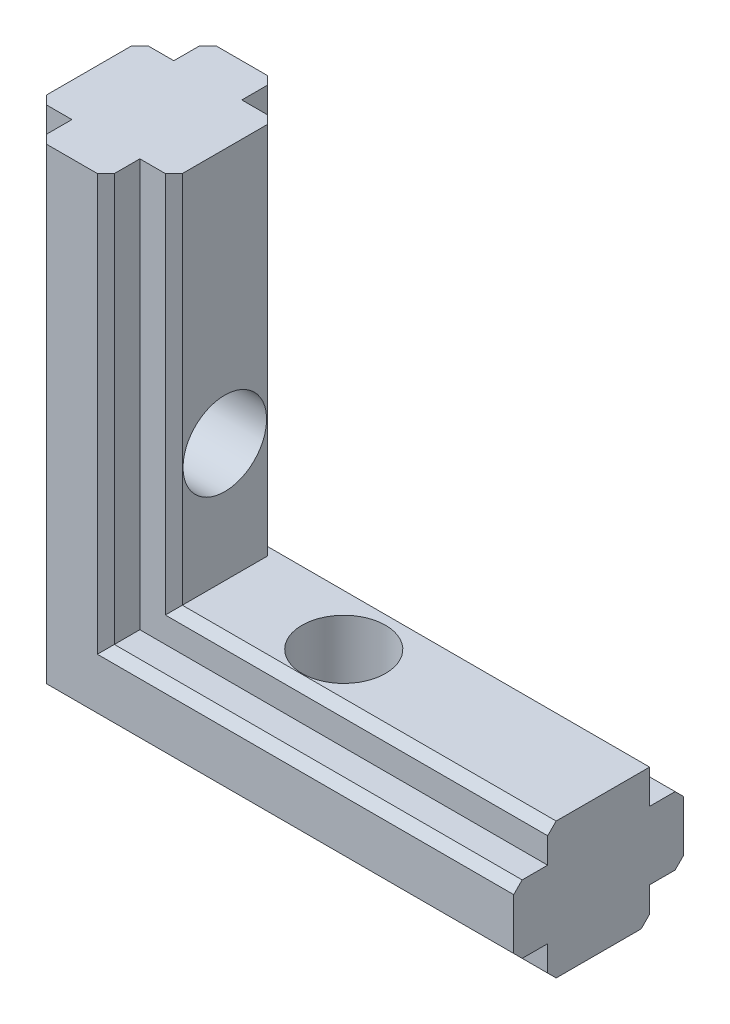
ISO-10303-21;
HEADER;
FILE_DESCRIPTION(('STEP AP214'),'2;1');
FILE_NAME('part.step','',(''),(''),'','','');
FILE_SCHEMA(('AUTOMOTIVE_DESIGN { 1 0 10303 214 1 1 1 1 }'));
ENDSEC;
DATA;
#1=APPLICATION_CONTEXT('core data for automotive mechanical design processes');
#2=APPLICATION_PROTOCOL_DEFINITION('international standard','automotive_design',2000,#1);
#3=PRODUCT_CONTEXT('',#1,'mechanical');
#4=PRODUCT('Part','Part','',(#3));
#5=PRODUCT_RELATED_PRODUCT_CATEGORY('part','',(#4));
#6=PRODUCT_DEFINITION_FORMATION('','',#4);
#7=PRODUCT_DEFINITION_CONTEXT('part definition',#1,'design');
#8=PRODUCT_DEFINITION('design','',#6,#7);
#9=PRODUCT_DEFINITION_SHAPE('','',#8);
#10=(LENGTH_UNIT() NAMED_UNIT(*) SI_UNIT(.MILLI.,.METRE.));
#11=(NAMED_UNIT(*) PLANE_ANGLE_UNIT() SI_UNIT($,.RADIAN.));
#12=(NAMED_UNIT(*) SI_UNIT($,.STERADIAN.) SOLID_ANGLE_UNIT());
#13=UNCERTAINTY_MEASURE_WITH_UNIT(LENGTH_MEASURE(1.E-05),#10,'distance_accuracy_value','');
#14=(GEOMETRIC_REPRESENTATION_CONTEXT(3) GLOBAL_UNCERTAINTY_ASSIGNED_CONTEXT((#13)) GLOBAL_UNIT_ASSIGNED_CONTEXT((#10,
#11,#12)) REPRESENTATION_CONTEXT('',''));
#15=CARTESIAN_POINT('',(0.,0.,0.));
#16=DIRECTION('',(0.,0.,1.));
#17=DIRECTION('',(1.,0.,0.));
#18=AXIS2_PLACEMENT_3D('',#15,#16,#17);
#19=CARTESIAN_POINT('',(30.,2.,0.));
#20=DIRECTION('',(0.,1.,0.));
#21=DIRECTION('',(0.,0.,1.));
#22=AXIS2_PLACEMENT_3D('',#19,#20,#21);
#23=PLANE('',#22);
#24=DIRECTION('',(0.,0.,1.));
#25=VECTOR('',#24,1.);
#26=CARTESIAN_POINT('',(30.,2.,0.));
#27=LINE('',#26,#25);
#28=CARTESIAN_POINT('',(30.,2.,2.));
#29=VERTEX_POINT('',#28);
#30=CARTESIAN_POINT('',(30.,2.,0.5));
#31=VERTEX_POINT('',#30);
#32=EDGE_CURVE('E217',#29,#31,#27,.F.);
#33=ORIENTED_EDGE('',*,*,#32,.F.);
#34=DIRECTION('',(1.,0.,0.));
#35=VECTOR('',#34,1.);
#36=CARTESIAN_POINT('',(1.,2.,2.));
#37=LINE('',#36,#35);
#38=CARTESIAN_POINT('',(2.,2.,2.));
#39=VERTEX_POINT('',#38);
#40=EDGE_CURVE('E211',#29,#39,#37,.F.);
#41=ORIENTED_EDGE('',*,*,#40,.T.);
#42=DIRECTION('',(0.,0.,-1.));
#43=VECTOR('',#42,1.);
#44=CARTESIAN_POINT('',(2.,2.,0.));
#45=LINE('',#44,#43);
#46=CARTESIAN_POINT('',(2.,2.,0.5));
#47=VERTEX_POINT('',#46);
#48=EDGE_CURVE('E224',#39,#47,#45,.T.);
#49=ORIENTED_EDGE('',*,*,#48,.T.);
#50=DIRECTION('',(1.,0.,0.));
#51=VECTOR('',#50,1.);
#52=CARTESIAN_POINT('',(17.,2.,0.5));
#53=LINE('',#52,#51);
#54=EDGE_CURVE('E227',#31,#47,#53,.F.);
#55=ORIENTED_EDGE('',*,*,#54,.F.);
#56=EDGE_LOOP('',(#33,#41,#49,#55));
#57=FACE_BOUND('',#56,.T.);
#58=ADVANCED_FACE('F19',(#57),#23,.F.);
#59=CARTESIAN_POINT('',(2.,2.,0.));
#60=DIRECTION('',(1.,0.,0.));
#61=DIRECTION('',(0.,0.,-1.));
#62=AXIS2_PLACEMENT_3D('',#59,#60,#61);
#63=PLANE('',#62);
#64=ORIENTED_EDGE('',*,*,#48,.F.);
#65=DIRECTION('',(0.,1.,0.));
#66=VECTOR('',#65,1.);
#67=CARTESIAN_POINT('',(2.,16.,2.));
#68=LINE('',#67,#66);
#69=CARTESIAN_POINT('',(2.,30.,2.));
#70=VERTEX_POINT('',#69);
#71=EDGE_CURVE('E236',#39,#70,#68,.T.);
#72=ORIENTED_EDGE('',*,*,#71,.T.);
#73=DIRECTION('',(0.,0.,-1.));
#74=VECTOR('',#73,1.);
#75=CARTESIAN_POINT('',(2.,30.,0.));
#76=LINE('',#75,#74);
#77=CARTESIAN_POINT('',(2.,30.,0.5));
#78=VERTEX_POINT('',#77);
#79=EDGE_CURVE('E230',#78,#70,#76,.F.);
#80=ORIENTED_EDGE('',*,*,#79,.F.);
#81=DIRECTION('',(0.,1.,0.));
#82=VECTOR('',#81,1.);
#83=CARTESIAN_POINT('',(2.,10.5,0.5));
#84=LINE('',#83,#82);
#85=EDGE_CURVE('E454',#47,#78,#84,.T.);
#86=ORIENTED_EDGE('',*,*,#85,.F.);
#87=EDGE_LOOP('',(#64,#72,#80,#86));
#88=FACE_BOUND('',#87,.T.);
#89=ADVANCED_FACE('F721',(#88),#63,.F.);
#90=CARTESIAN_POINT('',(1.,16.,2.));
#91=DIRECTION('',(0.,0.,1.));
#92=DIRECTION('',(1.,0.,0.));
#93=AXIS2_PLACEMENT_3D('',#90,#91,#92);
#94=PLANE('',#93);
#95=DIRECTION('',(1.,0.,0.));
#96=VECTOR('',#95,1.);
#97=CARTESIAN_POINT('',(1.,30.,2.));
#98=LINE('',#97,#96);
#99=CARTESIAN_POINT('',(0.5,30.,2.));
#100=VERTEX_POINT('',#99);
#101=EDGE_CURVE('E241',#70,#100,#98,.F.);
#102=ORIENTED_EDGE('',*,*,#101,.F.);
#103=ORIENTED_EDGE('',*,*,#71,.F.);
#104=ORIENTED_EDGE('',*,*,#40,.F.);
#105=DIRECTION('',(0.,1.,0.));
#106=VECTOR('',#105,1.);
#107=CARTESIAN_POINT('',(30.,16.,2.));
#108=LINE('',#107,#106);
#109=CARTESIAN_POINT('',(30.,0.5,2.));
#110=VERTEX_POINT('',#109);
#111=EDGE_CURVE('E215',#110,#29,#108,.T.);
#112=ORIENTED_EDGE('',*,*,#111,.F.);
#113=DIRECTION('',(1.,0.,0.));
#114=VECTOR('',#113,1.);
#115=CARTESIAN_POINT('',(0.5,0.5,2.));
#116=LINE('',#115,#114);
#117=CARTESIAN_POINT('',(0.5,0.499999999999999,2.));
#118=VERTEX_POINT('',#117);
#119=EDGE_CURVE('E257',#118,#110,#116,.T.);
#120=ORIENTED_EDGE('',*,*,#119,.F.);
#121=DIRECTION('',(0.,1.,0.));
#122=VECTOR('',#121,1.);
#123=CARTESIAN_POINT('',(0.5,23.,2.));
#124=LINE('',#123,#122);
#125=EDGE_CURVE('E390',#100,#118,#124,.F.);
#126=ORIENTED_EDGE('',*,*,#125,.F.);
#127=EDGE_LOOP('',(#102,#103,#104,#112,#120,#126));
#128=FACE_BOUND('',#127,.T.);
#129=ADVANCED_FACE('F234',(#128),#94,.F.);
#130=CARTESIAN_POINT('',(0.25,23.,2.25));
#131=DIRECTION('',(-0.707106781186547,0.,-0.707106781186548));
#132=DIRECTION('',(-0.707106781186548,0.,0.707106781186547));
#133=AXIS2_PLACEMENT_3D('',#130,#131,#132);
#134=PLANE('',#133);
#135=ORIENTED_EDGE('',*,*,#125,.T.);
#136=DIRECTION('',(0.577350269189626,0.577350269189626,-0.577350269189625));
#137=VECTOR('',#136,1.);
#138=CARTESIAN_POINT('',(0.,0.,2.5));
#139=LINE('',#138,#137);
#140=CARTESIAN_POINT('',(0.,0.,2.5));
#141=VERTEX_POINT('',#140);
#142=EDGE_CURVE('E409',#141,#118,#139,.T.);
#143=ORIENTED_EDGE('',*,*,#142,.F.);
#144=DIRECTION('',(0.,1.,0.));
#145=VECTOR('',#144,1.);
#146=CARTESIAN_POINT('',(0.,30.,2.5));
#147=LINE('',#146,#145);
#148=CARTESIAN_POINT('',(0.,30.,2.5));
#149=VERTEX_POINT('',#148);
#150=EDGE_CURVE('E407',#149,#141,#147,.F.);
#151=ORIENTED_EDGE('',*,*,#150,.F.);
#152=DIRECTION('',(-0.707106781186548,0.,0.707106781186547));
#153=VECTOR('',#152,1.);
#154=CARTESIAN_POINT('',(0.25,30.,2.25));
#155=LINE('',#154,#153);
#156=EDGE_CURVE('E394',#149,#100,#155,.F.);
#157=ORIENTED_EDGE('',*,*,#156,.T.);
#158=EDGE_LOOP('',(#135,#143,#151,#157));
#159=FACE_BOUND('',#158,.T.);
#160=ADVANCED_FACE('F405',(#159),#134,.T.);
#161=CARTESIAN_POINT('',(0.25,19.2333333333333,7.75));
#162=DIRECTION('',(-0.707106781186548,0.,0.707106781186548));
#163=DIRECTION('',(0.707106781186548,0.,0.707106781186548));
#164=AXIS2_PLACEMENT_3D('',#161,#162,#163);
#165=PLANE('',#164);
#166=DIRECTION('',(0.,1.,0.));
#167=VECTOR('',#166,1.);
#168=CARTESIAN_POINT('',(0.,30.,7.5));
#169=LINE('',#168,#167);
#170=CARTESIAN_POINT('',(0.,0.,7.5));
#171=VERTEX_POINT('',#170);
#172=CARTESIAN_POINT('',(0.,30.,7.5));
#173=VERTEX_POINT('',#172);
#174=EDGE_CURVE('E415',#171,#173,#169,.T.);
#175=ORIENTED_EDGE('',*,*,#174,.F.);
#176=DIRECTION('',(-0.577350269189625,-0.577350269189626,-0.577350269189626));
#177=VECTOR('',#176,1.);
#178=CARTESIAN_POINT('',(0.499999999999998,0.5,8.));
#179=LINE('',#178,#177);
#180=CARTESIAN_POINT('',(0.499999999999999,0.499999999999997,8.));
#181=VERTEX_POINT('',#180);
#182=EDGE_CURVE('E371',#181,#171,#179,.T.);
#183=ORIENTED_EDGE('',*,*,#182,.F.);
#184=DIRECTION('',(0.,1.,0.));
#185=VECTOR('',#184,1.);
#186=CARTESIAN_POINT('',(0.5,8.46666666666667,8.));
#187=LINE('',#186,#185);
#188=CARTESIAN_POINT('',(0.5,30.,8.));
#189=VERTEX_POINT('',#188);
#190=EDGE_CURVE('E425',#189,#181,#187,.F.);
#191=ORIENTED_EDGE('',*,*,#190,.F.);
#192=DIRECTION('',(0.707106781186548,0.,0.707106781186548));
#193=VECTOR('',#192,1.);
#194=CARTESIAN_POINT('',(0.25,30.,7.75));
#195=LINE('',#194,#193);
#196=EDGE_CURVE('E387',#189,#173,#195,.F.);
#197=ORIENTED_EDGE('',*,*,#196,.T.);
#198=EDGE_LOOP('',(#175,#183,#191,#197));
#199=FACE_BOUND('',#198,.T.);
#200=ADVANCED_FACE('F426',(#199),#165,.T.);
#201=CARTESIAN_POINT('',(7.75,10.4791666666667,7.75));
#202=DIRECTION('',(0.707106781186548,0.,0.707106781186548));
#203=DIRECTION('',(0.707106781186548,0.,-0.707106781186548));
#204=AXIS2_PLACEMENT_3D('',#201,#202,#203);
#205=PLANE('',#204);
#206=DIRECTION('',(0.,1.,0.));
#207=VECTOR('',#206,1.);
#208=CARTESIAN_POINT('',(7.5,12.9583333333333,8.));
#209=LINE('',#208,#207);
#210=CARTESIAN_POINT('',(7.5,7.5,8.));
#211=VERTEX_POINT('',#210);
#212=CARTESIAN_POINT('',(7.5,30.,8.));
#213=VERTEX_POINT('',#212);
#214=EDGE_CURVE('E366',#211,#213,#209,.T.);
#215=ORIENTED_EDGE('',*,*,#214,.F.);
#216=DIRECTION('',(-0.577350269189626,-0.577350269189626,0.577350269189626));
#217=VECTOR('',#216,1.);
#218=CARTESIAN_POINT('',(8.,8.,7.5));
#219=LINE('',#218,#217);
#220=CARTESIAN_POINT('',(8.,8.,7.5));
#221=VERTEX_POINT('',#220);
#222=EDGE_CURVE('E262',#221,#211,#219,.T.);
#223=ORIENTED_EDGE('',*,*,#222,.F.);
#224=DIRECTION('',(0.,1.,0.));
#225=VECTOR('',#224,1.);
#226=CARTESIAN_POINT('',(8.,8.,7.5));
#227=LINE('',#226,#225);
#228=CARTESIAN_POINT('',(8.,30.,7.5));
#229=VERTEX_POINT('',#228);
#230=EDGE_CURVE('E319',#229,#221,#227,.F.);
#231=ORIENTED_EDGE('',*,*,#230,.F.);
#232=DIRECTION('',(0.707106781186548,0.,-0.707106781186548));
#233=VECTOR('',#232,1.);
#234=CARTESIAN_POINT('',(7.75,30.,7.75));
#235=LINE('',#234,#233);
#236=EDGE_CURVE('E383',#229,#213,#235,.F.);
#237=ORIENTED_EDGE('',*,*,#236,.T.);
#238=EDGE_LOOP('',(#215,#223,#231,#237));
#239=FACE_BOUND('',#238,.T.);
#240=ADVANCED_FACE('F675',(#239),#205,.T.);
#241=CARTESIAN_POINT('',(43.5889894354067,15.,5.));
#242=DIRECTION('',(-1.,0.,0.));
#243=DIRECTION('',(0.,0.,1.));
#244=AXIS2_PLACEMENT_3D('',#241,#242,#243);
#245=CYLINDRICAL_SURFACE('',#244,2.4585);
#246=CARTESIAN_POINT('',(0.,15.,5.));
#247=DIRECTION('',(-1.,0.,0.));
#248=DIRECTION('',(0.,0.,1.));
#249=AXIS2_PLACEMENT_3D('',#246,#247,#248);
#250=CIRCLE('',#249,2.4585);
#251=CARTESIAN_POINT('',(0.,15.,7.4585));
#252=VERTEX_POINT('',#251);
#253=EDGE_CURVE('E321',#252,#252,#250,.F.);
#254=ORIENTED_EDGE('',*,*,#253,.F.);
#255=EDGE_LOOP('',(#254));
#256=FACE_BOUND('',#255,.T.);
#257=CARTESIAN_POINT('',(8.,15.,5.));
#258=DIRECTION('',(-1.,0.,0.));
#259=DIRECTION('',(0.,0.,1.));
#260=AXIS2_PLACEMENT_3D('',#257,#258,#259);
#261=CIRCLE('',#260,2.4585);
#262=CARTESIAN_POINT('',(8.,15.,7.4585));
#263=VERTEX_POINT('',#262);
#264=EDGE_CURVE('E313',#263,#263,#261,.T.);
#265=ORIENTED_EDGE('',*,*,#264,.F.);
#266=EDGE_LOOP('',(#265));
#267=FACE_BOUND('',#266,.T.);
#268=ADVANCED_FACE('F731',(#256,#267),#245,.F.);
#269=CARTESIAN_POINT('',(8.46666666666667,8.46666666666667,8.));
#270=DIRECTION('',(0.,0.,1.));
#271=DIRECTION('',(1.,0.,0.));
#272=AXIS2_PLACEMENT_3D('',#269,#270,#271);
#273=PLANE('',#272);
#274=DIRECTION('',(1.,0.,0.));
#275=VECTOR('',#274,1.);
#276=CARTESIAN_POINT('',(8.46666666666667,30.,8.));
#277=LINE('',#276,#275);
#278=CARTESIAN_POINT('',(2.,30.,8.));
#279=VERTEX_POINT('',#278);
#280=EDGE_CURVE('E382',#279,#189,#277,.F.);
#281=ORIENTED_EDGE('',*,*,#280,.T.);
#282=ORIENTED_EDGE('',*,*,#190,.T.);
#283=DIRECTION('',(1.,0.,0.));
#284=VECTOR('',#283,1.);
#285=CARTESIAN_POINT('',(4.23333333333333,0.5,8.));
#286=LINE('',#285,#284);
#287=CARTESIAN_POINT('',(30.,0.5,8.));
#288=VERTEX_POINT('',#287);
#289=EDGE_CURVE('E488',#288,#181,#286,.F.);
#290=ORIENTED_EDGE('',*,*,#289,.F.);
#291=DIRECTION('',(0.,1.,0.));
#292=VECTOR('',#291,1.);
#293=CARTESIAN_POINT('',(30.,8.46666666666667,8.));
#294=LINE('',#293,#292);
#295=CARTESIAN_POINT('',(30.,2.,8.));
#296=VERTEX_POINT('',#295);
#297=EDGE_CURVE('E376',#288,#296,#294,.T.);
#298=ORIENTED_EDGE('',*,*,#297,.T.);
#299=DIRECTION('',(1.,0.,0.));
#300=VECTOR('',#299,1.);
#301=CARTESIAN_POINT('',(2.,2.,8.));
#302=LINE('',#301,#300);
#303=CARTESIAN_POINT('',(2.,2.,8.));
#304=VERTEX_POINT('',#303);
#305=EDGE_CURVE('E511',#296,#304,#302,.F.);
#306=ORIENTED_EDGE('',*,*,#305,.T.);
#307=DIRECTION('',(0.,1.,0.));
#308=VECTOR('',#307,1.);
#309=CARTESIAN_POINT('',(2.,30.,8.));
#310=LINE('',#309,#308);
#311=EDGE_CURVE('E318',#304,#279,#310,.T.);
#312=ORIENTED_EDGE('',*,*,#311,.T.);
#313=EDGE_LOOP('',(#281,#282,#290,#298,#306,#312));
#314=FACE_BOUND('',#313,.T.);
#315=ADVANCED_FACE('F433',(#314),#273,.T.);
#316=CARTESIAN_POINT('',(17.,2.25,0.25));
#317=DIRECTION('',(0.,-0.707106781186548,-0.707106781186547));
#318=DIRECTION('',(0.,0.707106781186547,-0.707106781186548));
#319=AXIS2_PLACEMENT_3D('',#316,#317,#318);
#320=PLANE('',#319);
#321=ORIENTED_EDGE('',*,*,#54,.T.);
#322=DIRECTION('',(-0.577350269189625,-0.577350269189626,0.577350269189626));
#323=VECTOR('',#322,1.);
#324=CARTESIAN_POINT('',(2.5,2.5,0.));
#325=LINE('',#324,#323);
#326=CARTESIAN_POINT('',(2.5,2.5,0.));
#327=VERTEX_POINT('',#326);
#328=EDGE_CURVE('E461',#327,#47,#325,.T.);
#329=ORIENTED_EDGE('',*,*,#328,.F.);
#330=DIRECTION('',(1.,0.,0.));
#331=VECTOR('',#330,1.);
#332=CARTESIAN_POINT('',(4.,2.5,0.));
#333=LINE('',#332,#331);
#334=CARTESIAN_POINT('',(30.,2.5,0.));
#335=VERTEX_POINT('',#334);
#336=EDGE_CURVE('E517',#327,#335,#333,.T.);
#337=ORIENTED_EDGE('',*,*,#336,.T.);
#338=DIRECTION('',(0.,0.707106781186547,-0.707106781186548));
#339=VECTOR('',#338,1.);
#340=CARTESIAN_POINT('',(30.,2.25,0.25));
#341=LINE('',#340,#339);
#342=EDGE_CURVE('E432',#335,#31,#341,.F.);
#343=ORIENTED_EDGE('',*,*,#342,.T.);
#344=EDGE_LOOP('',(#321,#329,#337,#343));
#345=FACE_BOUND('',#344,.T.);
#346=ADVANCED_FACE('F723',(#345),#320,.T.);
#347=CARTESIAN_POINT('',(6.,5.75,0.25));
#348=DIRECTION('',(0.,0.707106781186547,-0.707106781186548));
#349=DIRECTION('',(0.,0.707106781186548,0.707106781186547));
#350=AXIS2_PLACEMENT_3D('',#347,#348,#349);
#351=PLANE('',#350);
#352=DIRECTION('',(1.,0.,0.));
#353=VECTOR('',#352,1.);
#354=CARTESIAN_POINT('',(4.,5.5,0.));
#355=LINE('',#354,#353);
#356=CARTESIAN_POINT('',(30.,5.5,0.));
#357=VERTEX_POINT('',#356);
#358=CARTESIAN_POINT('',(5.5,5.5,0.));
#359=VERTEX_POINT('',#358);
#360=EDGE_CURVE('E520',#357,#359,#355,.F.);
#361=ORIENTED_EDGE('',*,*,#360,.T.);
#362=DIRECTION('',(-0.577350269189626,-0.577350269189626,-0.577350269189625));
#363=VECTOR('',#362,1.);
#364=CARTESIAN_POINT('',(6.,6.,0.5));
#365=LINE('',#364,#363);
#366=CARTESIAN_POINT('',(6.,5.99999999999999,0.499999999999999));
#367=VERTEX_POINT('',#366);
#368=EDGE_CURVE('E450',#367,#359,#365,.T.);
#369=ORIENTED_EDGE('',*,*,#368,.F.);
#370=DIRECTION('',(1.,0.,0.));
#371=VECTOR('',#370,1.);
#372=CARTESIAN_POINT('',(8.,6.,0.5));
#373=LINE('',#372,#371);
#374=CARTESIAN_POINT('',(30.,6.,0.5));
#375=VERTEX_POINT('',#374);
#376=EDGE_CURVE('E479',#367,#375,#373,.T.);
#377=ORIENTED_EDGE('',*,*,#376,.T.);
#378=DIRECTION('',(0.,0.707106781186548,0.707106781186547));
#379=VECTOR('',#378,1.);
#380=CARTESIAN_POINT('',(30.,5.75,0.25));
#381=LINE('',#380,#379);
#382=EDGE_CURVE('E443',#375,#357,#381,.F.);
#383=ORIENTED_EDGE('',*,*,#382,.T.);
#384=EDGE_LOOP('',(#361,#369,#377,#383));
#385=FACE_BOUND('',#384,.T.);
#386=ADVANCED_FACE('F706',(#385),#351,.T.);
#387=CARTESIAN_POINT('',(5.75,24.5,0.25));
#388=DIRECTION('',(0.707106781186547,0.,-0.707106781186548));
#389=DIRECTION('',(-0.707106781186548,0.,-0.707106781186547));
#390=AXIS2_PLACEMENT_3D('',#387,#388,#389);
#391=PLANE('',#390);
#392=DIRECTION('',(0.,1.,0.));
#393=VECTOR('',#392,1.);
#394=CARTESIAN_POINT('',(6.,30.,0.5));
#395=LINE('',#394,#393);
#396=CARTESIAN_POINT('',(6.,30.,0.5));
#397=VERTEX_POINT('',#396);
#398=EDGE_CURVE('E468',#397,#367,#395,.F.);
#399=ORIENTED_EDGE('',*,*,#398,.T.);
#400=ORIENTED_EDGE('',*,*,#368,.T.);
#401=DIRECTION('',(0.,1.,0.));
#402=VECTOR('',#401,1.);
#403=CARTESIAN_POINT('',(5.5,19.,0.));
#404=LINE('',#403,#402);
#405=CARTESIAN_POINT('',(5.5,30.,0.));
#406=VERTEX_POINT('',#405);
#407=EDGE_CURVE('E523',#359,#406,#404,.T.);
#408=ORIENTED_EDGE('',*,*,#407,.T.);
#409=DIRECTION('',(-0.707106781186548,0.,-0.707106781186547));
#410=VECTOR('',#409,1.);
#411=CARTESIAN_POINT('',(5.75,30.,0.25));
#412=LINE('',#411,#410);
#413=EDGE_CURVE('E446',#406,#397,#412,.F.);
#414=ORIENTED_EDGE('',*,*,#413,.T.);
#415=EDGE_LOOP('',(#399,#400,#408,#414));
#416=FACE_BOUND('',#415,.T.);
#417=ADVANCED_FACE('F710',(#416),#391,.T.);
#418=CARTESIAN_POINT('',(2.25,10.5,0.25));
#419=DIRECTION('',(-0.707106781186548,0.,-0.707106781186547));
#420=DIRECTION('',(-0.707106781186547,0.,0.707106781186548));
#421=AXIS2_PLACEMENT_3D('',#418,#419,#420);
#422=PLANE('',#421);
#423=DIRECTION('',(0.,1.,0.));
#424=VECTOR('',#423,1.);
#425=CARTESIAN_POINT('',(2.5,19.,0.));
#426=LINE('',#425,#424);
#427=CARTESIAN_POINT('',(2.5,30.,0.));
#428=VERTEX_POINT('',#427);
#429=EDGE_CURVE('E527',#428,#327,#426,.F.);
#430=ORIENTED_EDGE('',*,*,#429,.T.);
#431=ORIENTED_EDGE('',*,*,#328,.T.);
#432=ORIENTED_EDGE('',*,*,#85,.T.);
#433=DIRECTION('',(-0.707106781186547,0.,0.707106781186548));
#434=VECTOR('',#433,1.);
#435=CARTESIAN_POINT('',(2.25,30.,0.25));
#436=LINE('',#435,#434);
#437=EDGE_CURVE('E458',#78,#428,#436,.F.);
#438=ORIENTED_EDGE('',*,*,#437,.T.);
#439=EDGE_LOOP('',(#430,#431,#432,#438));
#440=FACE_BOUND('',#439,.T.);
#441=ADVANCED_FACE('F718',(#440),#422,.T.);
#442=CARTESIAN_POINT('',(6.,30.,0.));
#443=DIRECTION('',(-1.,0.,0.));
#444=DIRECTION('',(0.,0.,1.));
#445=AXIS2_PLACEMENT_3D('',#442,#443,#444);
#446=PLANE('',#445);
#447=DIRECTION('',(0.,0.,1.));
#448=VECTOR('',#447,1.);
#449=CARTESIAN_POINT('',(6.,30.,0.));
#450=LINE('',#449,#448);
#451=CARTESIAN_POINT('',(6.,30.,2.));
#452=VERTEX_POINT('',#451);
#453=EDGE_CURVE('E465',#452,#397,#450,.F.);
#454=ORIENTED_EDGE('',*,*,#453,.F.);
#455=DIRECTION('',(0.,1.,0.));
#456=VECTOR('',#455,1.);
#457=CARTESIAN_POINT('',(6.,7.,2.));
#458=LINE('',#457,#456);
#459=CARTESIAN_POINT('',(6.,6.,2.));
#460=VERTEX_POINT('',#459);
#461=EDGE_CURVE('E531',#452,#460,#458,.F.);
#462=ORIENTED_EDGE('',*,*,#461,.T.);
#463=DIRECTION('',(0.,0.,-1.));
#464=VECTOR('',#463,1.);
#465=CARTESIAN_POINT('',(6.,6.,0.));
#466=LINE('',#465,#464);
#467=EDGE_CURVE('E475',#460,#367,#466,.T.);
#468=ORIENTED_EDGE('',*,*,#467,.T.);
#469=ORIENTED_EDGE('',*,*,#398,.F.);
#470=EDGE_LOOP('',(#454,#462,#468,#469));
#471=FACE_BOUND('',#470,.T.);
#472=ADVANCED_FACE('F699',(#471),#446,.F.);
#473=CARTESIAN_POINT('',(8.,6.,0.));
#474=DIRECTION('',(0.,-1.,0.));
#475=DIRECTION('',(0.,0.,-1.));
#476=AXIS2_PLACEMENT_3D('',#473,#474,#475);
#477=PLANE('',#476);
#478=ORIENTED_EDGE('',*,*,#467,.F.);
#479=DIRECTION('',(1.,0.,0.));
#480=VECTOR('',#479,1.);
#481=CARTESIAN_POINT('',(19.,6.,2.));
#482=LINE('',#481,#480);
#483=CARTESIAN_POINT('',(30.,6.,2.));
#484=VERTEX_POINT('',#483);
#485=EDGE_CURVE('E298',#460,#484,#482,.T.);
#486=ORIENTED_EDGE('',*,*,#485,.T.);
#487=DIRECTION('',(0.,0.,-1.));
#488=VECTOR('',#487,1.);
#489=CARTESIAN_POINT('',(30.,6.,0.));
#490=LINE('',#489,#488);
#491=EDGE_CURVE('E472',#375,#484,#490,.F.);
#492=ORIENTED_EDGE('',*,*,#491,.F.);
#493=ORIENTED_EDGE('',*,*,#376,.F.);
#494=EDGE_LOOP('',(#478,#486,#492,#493));
#495=FACE_BOUND('',#494,.T.);
#496=ADVANCED_FACE('F703',(#495),#477,.F.);
#497=CARTESIAN_POINT('',(7.75,7.5,2.25));
#498=DIRECTION('',(0.707106781186547,0.,-0.707106781186548));
#499=DIRECTION('',(-0.707106781186548,0.,-0.707106781186547));
#500=AXIS2_PLACEMENT_3D('',#497,#498,#499);
#501=PLANE('',#500);
#502=DIRECTION('',(-0.707106781186548,0.,-0.707106781186547));
#503=VECTOR('',#502,1.);
#504=CARTESIAN_POINT('',(7.75,8.,2.25));
#505=LINE('',#504,#503);
#506=CARTESIAN_POINT('',(8.,8.,2.5));
#507=VERTEX_POINT('',#506);
#508=CARTESIAN_POINT('',(7.5,8.,2.));
#509=VERTEX_POINT('',#508);
#510=EDGE_CURVE('E270',#507,#509,#505,.T.);
#511=ORIENTED_EDGE('',*,*,#510,.T.);
#512=DIRECTION('',(0.,1.,0.));
#513=VECTOR('',#512,1.);
#514=CARTESIAN_POINT('',(7.5,7.,2.));
#515=LINE('',#514,#513);
#516=CARTESIAN_POINT('',(7.5,30.,2.));
#517=VERTEX_POINT('',#516);
#518=EDGE_CURVE('E292',#509,#517,#515,.T.);
#519=ORIENTED_EDGE('',*,*,#518,.T.);
#520=DIRECTION('',(-0.707106781186548,0.,-0.707106781186547));
#521=VECTOR('',#520,1.);
#522=CARTESIAN_POINT('',(7.75,30.,2.25));
#523=LINE('',#522,#521);
#524=CARTESIAN_POINT('',(8.,30.,2.5));
#525=VERTEX_POINT('',#524);
#526=EDGE_CURVE('E274',#517,#525,#523,.F.);
#527=ORIENTED_EDGE('',*,*,#526,.T.);
#528=DIRECTION('',(0.,1.,0.));
#529=VECTOR('',#528,1.);
#530=CARTESIAN_POINT('',(8.,8.,2.5));
#531=LINE('',#530,#529);
#532=EDGE_CURVE('E501',#507,#525,#531,.T.);
#533=ORIENTED_EDGE('',*,*,#532,.F.);
#534=EDGE_LOOP('',(#511,#519,#527,#533));
#535=FACE_BOUND('',#534,.T.);
#536=ADVANCED_FACE('F690',(#535),#501,.T.);
#537=CARTESIAN_POINT('',(21.4791666666667,7.75,7.75));
#538=DIRECTION('',(0.,0.707106781186548,0.707106781186547));
#539=DIRECTION('',(0.,-0.707106781186547,0.707106781186548));
#540=AXIS2_PLACEMENT_3D('',#537,#538,#539);
#541=PLANE('',#540);
#542=DIRECTION('',(1.,0.,0.));
#543=VECTOR('',#542,1.);
#544=CARTESIAN_POINT('',(30.,8.,7.5));
#545=LINE('',#544,#543);
#546=CARTESIAN_POINT('',(30.,8.,7.5));
#547=VERTEX_POINT('',#546);
#548=EDGE_CURVE('E285',#221,#547,#545,.T.);
#549=ORIENTED_EDGE('',*,*,#548,.F.);
#550=ORIENTED_EDGE('',*,*,#222,.T.);
#551=DIRECTION('',(1.,0.,0.));
#552=VECTOR('',#551,1.);
#553=CARTESIAN_POINT('',(12.9583333333333,7.5,8.));
#554=LINE('',#553,#552);
#555=CARTESIAN_POINT('',(30.,7.5,8.));
#556=VERTEX_POINT('',#555);
#557=EDGE_CURVE('E360',#556,#211,#554,.F.);
#558=ORIENTED_EDGE('',*,*,#557,.F.);
#559=DIRECTION('',(0.,-0.707106781186547,0.707106781186548));
#560=VECTOR('',#559,1.);
#561=CARTESIAN_POINT('',(30.,7.75,7.75));
#562=LINE('',#561,#560);
#563=EDGE_CURVE('E267',#556,#547,#562,.F.);
#564=ORIENTED_EDGE('',*,*,#563,.T.);
#565=EDGE_LOOP('',(#549,#550,#558,#564));
#566=FACE_BOUND('',#565,.T.);
#567=ADVANCED_FACE('F679',(#566),#541,.T.);
#568=CARTESIAN_POINT('',(0.5,0.25,2.25));
#569=DIRECTION('',(0.,-0.707106781186547,-0.707106781186548));
#570=DIRECTION('',(0.,0.707106781186548,-0.707106781186547));
#571=AXIS2_PLACEMENT_3D('',#568,#569,#570);
#572=PLANE('',#571);
#573=DIRECTION('',(1.,0.,0.));
#574=VECTOR('',#573,1.);
#575=CARTESIAN_POINT('',(0.,0.,2.5));
#576=LINE('',#575,#574);
#577=CARTESIAN_POINT('',(30.,0.,2.5));
#578=VERTEX_POINT('',#577);
#579=EDGE_CURVE('E543',#141,#578,#576,.T.);
#580=ORIENTED_EDGE('',*,*,#579,.F.);
#581=ORIENTED_EDGE('',*,*,#142,.T.);
#582=ORIENTED_EDGE('',*,*,#119,.T.);
#583=DIRECTION('',(0.,0.707106781186548,-0.707106781186547));
#584=VECTOR('',#583,1.);
#585=CARTESIAN_POINT('',(30.,0.25,2.25));
#586=LINE('',#585,#584);
#587=EDGE_CURVE('E220',#110,#578,#586,.F.);
#588=ORIENTED_EDGE('',*,*,#587,.T.);
#589=EDGE_LOOP('',(#580,#581,#582,#588));
#590=FACE_BOUND('',#589,.T.);
#591=ADVANCED_FACE('F783',(#590),#572,.T.);
#592=CARTESIAN_POINT('',(4.23333333333333,0.25,7.75));
#593=DIRECTION('',(0.,-0.707106781186548,0.707106781186548));
#594=DIRECTION('',(0.,-0.707106781186548,-0.707106781186548));
#595=AXIS2_PLACEMENT_3D('',#592,#593,#594);
#596=PLANE('',#595);
#597=ORIENTED_EDGE('',*,*,#289,.T.);
#598=ORIENTED_EDGE('',*,*,#182,.T.);
#599=DIRECTION('',(1.,0.,0.));
#600=VECTOR('',#599,1.);
#601=CARTESIAN_POINT('',(0.,0.,7.5));
#602=LINE('',#601,#600);
#603=CARTESIAN_POINT('',(30.,0.,7.5));
#604=VERTEX_POINT('',#603);
#605=EDGE_CURVE('E546',#604,#171,#602,.F.);
#606=ORIENTED_EDGE('',*,*,#605,.F.);
#607=DIRECTION('',(0.,-0.707106781186548,-0.707106781186548));
#608=VECTOR('',#607,1.);
#609=CARTESIAN_POINT('',(30.,0.25,7.75));
#610=LINE('',#609,#608);
#611=EDGE_CURVE('E485',#604,#288,#610,.F.);
#612=ORIENTED_EDGE('',*,*,#611,.T.);
#613=EDGE_LOOP('',(#597,#598,#606,#612));
#614=FACE_BOUND('',#613,.T.);
#615=ADVANCED_FACE('F779',(#614),#596,.T.);
#616=CARTESIAN_POINT('',(15.,43.5889894354067,5.));
#617=DIRECTION('',(0.,-1.,0.));
#618=DIRECTION('',(0.,0.,-1.));
#619=AXIS2_PLACEMENT_3D('',#616,#617,#618);
#620=CYLINDRICAL_SURFACE('',#619,2.4585);
#621=CARTESIAN_POINT('',(15.,0.,5.));
#622=DIRECTION('',(0.,-1.,0.));
#623=DIRECTION('',(0.,0.,-1.));
#624=AXIS2_PLACEMENT_3D('',#621,#622,#623);
#625=CIRCLE('',#624,2.4585);
#626=CARTESIAN_POINT('',(15.,0.,2.5415));
#627=VERTEX_POINT('',#626);
#628=EDGE_CURVE('E552',#627,#627,#625,.F.);
#629=ORIENTED_EDGE('',*,*,#628,.F.);
#630=EDGE_LOOP('',(#629));
#631=FACE_BOUND('',#630,.T.);
#632=CARTESIAN_POINT('',(15.,8.,5.));
#633=DIRECTION('',(0.,-1.,0.));
#634=DIRECTION('',(0.,0.,-1.));
#635=AXIS2_PLACEMENT_3D('',#632,#633,#634);
#636=CIRCLE('',#635,2.4585);
#637=CARTESIAN_POINT('',(15.,8.,2.5415));
#638=VERTEX_POINT('',#637);
#639=EDGE_CURVE('E311',#638,#638,#636,.T.);
#640=ORIENTED_EDGE('',*,*,#639,.F.);
#641=EDGE_LOOP('',(#640));
#642=FACE_BOUND('',#641,.T.);
#643=ADVANCED_FACE('F776',(#631,#642),#620,.F.);
#644=CARTESIAN_POINT('',(12.9583333333333,12.9583333333333,8.));
#645=DIRECTION('',(0.,0.,1.));
#646=DIRECTION('',(1.,0.,0.));
#647=AXIS2_PLACEMENT_3D('',#644,#645,#646);
#648=PLANE('',#647);
#649=DIRECTION('',(0.,1.,0.));
#650=VECTOR('',#649,1.);
#651=CARTESIAN_POINT('',(30.,12.9583333333333,8.));
#652=LINE('',#651,#650);
#653=CARTESIAN_POINT('',(30.,6.,8.));
#654=VERTEX_POINT('',#653);
#655=EDGE_CURVE('E354',#654,#556,#652,.T.);
#656=ORIENTED_EDGE('',*,*,#655,.T.);
#657=ORIENTED_EDGE('',*,*,#557,.T.);
#658=ORIENTED_EDGE('',*,*,#214,.T.);
#659=DIRECTION('',(1.,0.,0.));
#660=VECTOR('',#659,1.);
#661=CARTESIAN_POINT('',(12.9583333333333,30.,8.));
#662=LINE('',#661,#660);
#663=CARTESIAN_POINT('',(6.,30.,8.));
#664=VERTEX_POINT('',#663);
#665=EDGE_CURVE('E361',#213,#664,#662,.F.);
#666=ORIENTED_EDGE('',*,*,#665,.T.);
#667=DIRECTION('',(0.,1.,0.));
#668=VECTOR('',#667,1.);
#669=CARTESIAN_POINT('',(6.,6.,8.));
#670=LINE('',#669,#668);
#671=CARTESIAN_POINT('',(6.,6.,8.));
#672=VERTEX_POINT('',#671);
#673=EDGE_CURVE('E416',#664,#672,#670,.F.);
#674=ORIENTED_EDGE('',*,*,#673,.T.);
#675=DIRECTION('',(1.,0.,0.));
#676=VECTOR('',#675,1.);
#677=CARTESIAN_POINT('',(30.,6.,8.));
#678=LINE('',#677,#676);
#679=EDGE_CURVE('E346',#672,#654,#678,.T.);
#680=ORIENTED_EDGE('',*,*,#679,.T.);
#681=EDGE_LOOP('',(#656,#657,#658,#666,#674,#680));
#682=FACE_BOUND('',#681,.T.);
#683=ADVANCED_FACE('F672',(#682),#648,.T.);
#684=CARTESIAN_POINT('',(6.,6.,10.));
#685=DIRECTION('',(-1.,0.,0.));
#686=DIRECTION('',(0.,0.,1.));
#687=AXIS2_PLACEMENT_3D('',#684,#685,#686);
#688=PLANE('',#687);
#689=DIRECTION('',(0.,0.,-1.));
#690=VECTOR('',#689,1.);
#691=CARTESIAN_POINT('',(6.,6.,10.));
#692=LINE('',#691,#690);
#693=CARTESIAN_POINT('',(6.,6.,9.5));
#694=VERTEX_POINT('',#693);
#695=EDGE_CURVE('E350',#694,#672,#692,.T.);
#696=ORIENTED_EDGE('',*,*,#695,.T.);
#697=ORIENTED_EDGE('',*,*,#673,.F.);
#698=DIRECTION('',(0.,0.,1.));
#699=VECTOR('',#698,1.);
#700=CARTESIAN_POINT('',(6.,30.,10.));
#701=LINE('',#700,#699);
#702=CARTESIAN_POINT('',(6.,30.,9.5));
#703=VERTEX_POINT('',#702);
#704=EDGE_CURVE('E494',#703,#664,#701,.F.);
#705=ORIENTED_EDGE('',*,*,#704,.F.);
#706=DIRECTION('',(0.,1.,0.));
#707=VECTOR('',#706,1.);
#708=CARTESIAN_POINT('',(6.,12.5,9.5));
#709=LINE('',#708,#707);
#710=EDGE_CURVE('E342',#694,#703,#709,.T.);
#711=ORIENTED_EDGE('',*,*,#710,.F.);
#712=EDGE_LOOP('',(#696,#697,#705,#711));
#713=FACE_BOUND('',#712,.T.);
#714=ADVANCED_FACE('F669',(#713),#688,.F.);
#715=CARTESIAN_POINT('',(0.,30.,0.));
#716=DIRECTION('',(-1.,0.,0.));
#717=DIRECTION('',(0.,0.,1.));
#718=AXIS2_PLACEMENT_3D('',#715,#716,#717);
#719=PLANE('',#718);
#720=ORIENTED_EDGE('',*,*,#253,.T.);
#721=EDGE_LOOP('',(#720));
#722=FACE_BOUND('',#721,.T.);
#723=ORIENTED_EDGE('',*,*,#174,.T.);
#724=DIRECTION('',(0.,0.,1.));
#725=VECTOR('',#724,1.);
#726=CARTESIAN_POINT('',(0.,30.,0.));
#727=LINE('',#726,#725);
#728=EDGE_CURVE('E337',#149,#173,#727,.T.);
#729=ORIENTED_EDGE('',*,*,#728,.F.);
#730=ORIENTED_EDGE('',*,*,#150,.T.);
#731=DIRECTION('',(0.,0.,-1.));
#732=VECTOR('',#731,1.);
#733=CARTESIAN_POINT('',(0.,0.,0.));
#734=LINE('',#733,#732);
#735=EDGE_CURVE('E549',#171,#141,#734,.T.);
#736=ORIENTED_EDGE('',*,*,#735,.F.);
#737=EDGE_LOOP('',(#723,#729,#730,#736));
#738=FACE_BOUND('',#737,.T.);
#739=ADVANCED_FACE('F419',(#722,#738),#719,.T.);
#740=CARTESIAN_POINT('',(8.,8.,0.));
#741=DIRECTION('',(1.,0.,0.));
#742=DIRECTION('',(0.,0.,-1.));
#743=AXIS2_PLACEMENT_3D('',#740,#741,#742);
#744=PLANE('',#743);
#745=ORIENTED_EDGE('',*,*,#264,.T.);
#746=EDGE_LOOP('',(#745));
#747=FACE_BOUND('',#746,.T.);
#748=ORIENTED_EDGE('',*,*,#230,.T.);
#749=DIRECTION('',(0.,0.,1.));
#750=VECTOR('',#749,1.);
#751=CARTESIAN_POINT('',(8.,8.,0.));
#752=LINE('',#751,#750);
#753=EDGE_CURVE('E538',#507,#221,#752,.T.);
#754=ORIENTED_EDGE('',*,*,#753,.F.);
#755=ORIENTED_EDGE('',*,*,#532,.T.);
#756=DIRECTION('',(0.,0.,1.));
#757=VECTOR('',#756,1.);
#758=CARTESIAN_POINT('',(8.,30.,0.));
#759=LINE('',#758,#757);
#760=EDGE_CURVE('E560',#229,#525,#759,.F.);
#761=ORIENTED_EDGE('',*,*,#760,.F.);
#762=EDGE_LOOP('',(#748,#754,#755,#761));
#763=FACE_BOUND('',#762,.T.);
#764=ADVANCED_FACE('F685',(#747,#763),#744,.T.);
#765=CARTESIAN_POINT('',(2.,30.,10.));
#766=DIRECTION('',(1.,0.,0.));
#767=DIRECTION('',(0.,0.,-1.));
#768=AXIS2_PLACEMENT_3D('',#765,#766,#767);
#769=PLANE('',#768);
#770=DIRECTION('',(0.,0.,1.));
#771=VECTOR('',#770,1.);
#772=CARTESIAN_POINT('',(2.,30.,0.));
#773=LINE('',#772,#771);
#774=CARTESIAN_POINT('',(2.,30.,9.5));
#775=VERTEX_POINT('',#774);
#776=EDGE_CURVE('E331',#279,#775,#773,.T.);
#777=ORIENTED_EDGE('',*,*,#776,.F.);
#778=ORIENTED_EDGE('',*,*,#311,.F.);
#779=DIRECTION('',(0.,0.,1.));
#780=VECTOR('',#779,1.);
#781=CARTESIAN_POINT('',(2.,2.,10.));
#782=LINE('',#781,#780);
#783=CARTESIAN_POINT('',(2.,2.,9.5));
#784=VERTEX_POINT('',#783);
#785=EDGE_CURVE('E514',#304,#784,#782,.T.);
#786=ORIENTED_EDGE('',*,*,#785,.T.);
#787=DIRECTION('',(0.,1.,0.));
#788=VECTOR('',#787,1.);
#789=CARTESIAN_POINT('',(2.,24.5,9.5));
#790=LINE('',#789,#788);
#791=EDGE_CURVE('E574',#775,#784,#790,.F.);
#792=ORIENTED_EDGE('',*,*,#791,.F.);
#793=EDGE_LOOP('',(#777,#778,#786,#792));
#794=FACE_BOUND('',#793,.T.);
#795=ADVANCED_FACE('F650',(#794),#769,.F.);
#796=CARTESIAN_POINT('',(2.,2.,10.));
#797=DIRECTION('',(0.,1.,0.));
#798=DIRECTION('',(0.,0.,1.));
#799=AXIS2_PLACEMENT_3D('',#796,#797,#798);
#800=PLANE('',#799);
#801=ORIENTED_EDGE('',*,*,#785,.F.);
#802=ORIENTED_EDGE('',*,*,#305,.F.);
#803=DIRECTION('',(0.,0.,1.));
#804=VECTOR('',#803,1.);
#805=CARTESIAN_POINT('',(30.,2.,10.));
#806=LINE('',#805,#804);
#807=CARTESIAN_POINT('',(30.,2.,9.5));
#808=VERTEX_POINT('',#807);
#809=EDGE_CURVE('E509',#808,#296,#806,.F.);
#810=ORIENTED_EDGE('',*,*,#809,.F.);
#811=DIRECTION('',(1.,0.,0.));
#812=VECTOR('',#811,1.);
#813=CARTESIAN_POINT('',(3.,2.,9.5));
#814=LINE('',#813,#812);
#815=EDGE_CURVE('E582',#784,#808,#814,.T.);
#816=ORIENTED_EDGE('',*,*,#815,.F.);
#817=EDGE_LOOP('',(#801,#802,#810,#816));
#818=FACE_BOUND('',#817,.T.);
#819=ADVANCED_FACE('F647',(#818),#800,.F.);
#820=CARTESIAN_POINT('',(4.,19.,0.));
#821=DIRECTION('',(0.,0.,1.));
#822=DIRECTION('',(1.,0.,0.));
#823=AXIS2_PLACEMENT_3D('',#820,#821,#822);
#824=PLANE('',#823);
#825=DIRECTION('',(1.,0.,0.));
#826=VECTOR('',#825,1.);
#827=CARTESIAN_POINT('',(8.,30.,0.));
#828=LINE('',#827,#826);
#829=EDGE_CURVE('E566',#406,#428,#828,.F.);
#830=ORIENTED_EDGE('',*,*,#829,.F.);
#831=ORIENTED_EDGE('',*,*,#407,.F.);
#832=ORIENTED_EDGE('',*,*,#360,.F.);
#833=DIRECTION('',(0.,1.,0.));
#834=VECTOR('',#833,1.);
#835=CARTESIAN_POINT('',(30.,0.,0.));
#836=LINE('',#835,#834);
#837=EDGE_CURVE('E586',#335,#357,#836,.T.);
#838=ORIENTED_EDGE('',*,*,#837,.F.);
#839=ORIENTED_EDGE('',*,*,#336,.F.);
#840=ORIENTED_EDGE('',*,*,#429,.F.);
#841=EDGE_LOOP('',(#830,#831,#832,#838,#839,#840));
#842=FACE_BOUND('',#841,.T.);
#843=ADVANCED_FACE('F714',(#842),#824,.F.);
#844=CARTESIAN_POINT('',(19.,7.,2.));
#845=DIRECTION('',(0.,0.,1.));
#846=DIRECTION('',(1.,0.,0.));
#847=AXIS2_PLACEMENT_3D('',#844,#845,#846);
#848=PLANE('',#847);
#849=DIRECTION('',(1.,0.,0.));
#850=VECTOR('',#849,1.);
#851=CARTESIAN_POINT('',(30.,8.,2.));
#852=LINE('',#851,#850);
#853=CARTESIAN_POINT('',(30.,8.,2.));
#854=VERTEX_POINT('',#853);
#855=EDGE_CURVE('E291',#854,#509,#852,.F.);
#856=ORIENTED_EDGE('',*,*,#855,.F.);
#857=DIRECTION('',(0.,1.,0.));
#858=VECTOR('',#857,1.);
#859=CARTESIAN_POINT('',(30.,0.,2.));
#860=LINE('',#859,#858);
#861=EDGE_CURVE('E590',#484,#854,#860,.T.);
#862=ORIENTED_EDGE('',*,*,#861,.F.);
#863=ORIENTED_EDGE('',*,*,#485,.F.);
#864=ORIENTED_EDGE('',*,*,#461,.F.);
#865=DIRECTION('',(1.,0.,0.));
#866=VECTOR('',#865,1.);
#867=CARTESIAN_POINT('',(8.,30.,2.));
#868=LINE('',#867,#866);
#869=EDGE_CURVE('E563',#517,#452,#868,.F.);
#870=ORIENTED_EDGE('',*,*,#869,.F.);
#871=ORIENTED_EDGE('',*,*,#518,.F.);
#872=EDGE_LOOP('',(#856,#862,#863,#864,#870,#871));
#873=FACE_BOUND('',#872,.T.);
#874=ADVANCED_FACE('F694',(#873),#848,.F.);
#875=CARTESIAN_POINT('',(30.,8.,0.));
#876=DIRECTION('',(0.,1.,0.));
#877=DIRECTION('',(0.,0.,1.));
#878=AXIS2_PLACEMENT_3D('',#875,#876,#877);
#879=PLANE('',#878);
#880=ORIENTED_EDGE('',*,*,#639,.T.);
#881=EDGE_LOOP('',(#880));
#882=FACE_BOUND('',#881,.T.);
#883=ORIENTED_EDGE('',*,*,#510,.F.);
#884=ORIENTED_EDGE('',*,*,#753,.T.);
#885=ORIENTED_EDGE('',*,*,#548,.T.);
#886=DIRECTION('',(0.,0.,-1.));
#887=VECTOR('',#886,1.);
#888=CARTESIAN_POINT('',(30.,8.,0.));
#889=LINE('',#888,#887);
#890=EDGE_CURVE('E594',#854,#547,#889,.F.);
#891=ORIENTED_EDGE('',*,*,#890,.F.);
#892=ORIENTED_EDGE('',*,*,#855,.T.);
#893=EDGE_LOOP('',(#883,#884,#885,#891,#892));
#894=FACE_BOUND('',#893,.T.);
#895=ADVANCED_FACE('F686',(#882,#894),#879,.T.);
#896=CARTESIAN_POINT('',(0.,0.,0.));
#897=DIRECTION('',(0.,-1.,0.));
#898=DIRECTION('',(0.,0.,-1.));
#899=AXIS2_PLACEMENT_3D('',#896,#897,#898);
#900=PLANE('',#899);
#901=ORIENTED_EDGE('',*,*,#628,.T.);
#902=EDGE_LOOP('',(#901));
#903=FACE_BOUND('',#902,.T.);
#904=ORIENTED_EDGE('',*,*,#605,.T.);
#905=ORIENTED_EDGE('',*,*,#735,.T.);
#906=ORIENTED_EDGE('',*,*,#579,.T.);
#907=DIRECTION('',(0.,0.,-1.));
#908=VECTOR('',#907,1.);
#909=CARTESIAN_POINT('',(30.,0.,0.));
#910=LINE('',#909,#908);
#911=EDGE_CURVE('E605',#604,#578,#910,.T.);
#912=ORIENTED_EDGE('',*,*,#911,.F.);
#913=EDGE_LOOP('',(#904,#905,#906,#912));
#914=FACE_BOUND('',#913,.T.);
#915=ADVANCED_FACE('F751',(#903,#914),#900,.T.);
#916=CARTESIAN_POINT('',(30.,6.,10.));
#917=DIRECTION('',(0.,-1.,0.));
#918=DIRECTION('',(0.,0.,-1.));
#919=AXIS2_PLACEMENT_3D('',#916,#917,#918);
#920=PLANE('',#919);
#921=DIRECTION('',(0.,0.,-1.));
#922=VECTOR('',#921,1.);
#923=CARTESIAN_POINT('',(30.,6.,0.));
#924=LINE('',#923,#922);
#925=CARTESIAN_POINT('',(30.,6.,9.5));
#926=VERTEX_POINT('',#925);
#927=EDGE_CURVE('E598',#654,#926,#924,.F.);
#928=ORIENTED_EDGE('',*,*,#927,.F.);
#929=ORIENTED_EDGE('',*,*,#679,.F.);
#930=ORIENTED_EDGE('',*,*,#695,.F.);
#931=DIRECTION('',(1.,0.,0.));
#932=VECTOR('',#931,1.);
#933=CARTESIAN_POINT('',(17.,6.,9.5));
#934=LINE('',#933,#932);
#935=EDGE_CURVE('E610',#926,#694,#934,.F.);
#936=ORIENTED_EDGE('',*,*,#935,.F.);
#937=EDGE_LOOP('',(#928,#929,#930,#936));
#938=FACE_BOUND('',#937,.T.);
#939=ADVANCED_FACE('F665',(#938),#920,.F.);
#940=CARTESIAN_POINT('',(5.75,12.5,9.75));
#941=DIRECTION('',(0.707106781186548,0.,0.707106781186548));
#942=DIRECTION('',(0.707106781186548,0.,-0.707106781186548));
#943=AXIS2_PLACEMENT_3D('',#940,#941,#942);
#944=PLANE('',#943);
#945=DIRECTION('',(0.,1.,0.));
#946=VECTOR('',#945,1.);
#947=CARTESIAN_POINT('',(5.5,19.,10.));
#948=LINE('',#947,#946);
#949=CARTESIAN_POINT('',(5.5,5.5,10.));
#950=VERTEX_POINT('',#949);
#951=CARTESIAN_POINT('',(5.5,30.,10.));
#952=VERTEX_POINT('',#951);
#953=EDGE_CURVE('E618',#950,#952,#948,.T.);
#954=ORIENTED_EDGE('',*,*,#953,.F.);
#955=DIRECTION('',(-0.577350269189626,-0.577350269189626,0.577350269189626));
#956=VECTOR('',#955,1.);
#957=CARTESIAN_POINT('',(6.,6.,9.5));
#958=LINE('',#957,#956);
#959=EDGE_CURVE('E614',#694,#950,#958,.T.);
#960=ORIENTED_EDGE('',*,*,#959,.F.);
#961=ORIENTED_EDGE('',*,*,#710,.T.);
#962=DIRECTION('',(0.707106781186547,0.,-0.707106781186547));
#963=VECTOR('',#962,1.);
#964=CARTESIAN_POINT('',(5.5,30.,10.));
#965=LINE('',#964,#963);
#966=EDGE_CURVE('E336',#952,#703,#965,.T.);
#967=ORIENTED_EDGE('',*,*,#966,.F.);
#968=EDGE_LOOP('',(#954,#960,#961,#967));
#969=FACE_BOUND('',#968,.T.);
#970=ADVANCED_FACE('F658',(#969),#944,.T.);
#971=CARTESIAN_POINT('',(8.,30.,0.));
#972=DIRECTION('',(0.,1.,0.));
#973=DIRECTION('',(0.,0.,1.));
#974=AXIS2_PLACEMENT_3D('',#971,#972,#973);
#975=PLANE('',#974);
#976=ORIENTED_EDGE('',*,*,#79,.T.);
#977=ORIENTED_EDGE('',*,*,#101,.T.);
#978=ORIENTED_EDGE('',*,*,#156,.F.);
#979=ORIENTED_EDGE('',*,*,#728,.T.);
#980=ORIENTED_EDGE('',*,*,#196,.F.);
#981=ORIENTED_EDGE('',*,*,#280,.F.);
#982=ORIENTED_EDGE('',*,*,#776,.T.);
#983=DIRECTION('',(0.707106781186548,0.,0.707106781186548));
#984=VECTOR('',#983,1.);
#985=CARTESIAN_POINT('',(2.25,30.,9.75));
#986=LINE('',#985,#984);
#987=CARTESIAN_POINT('',(2.5,30.,10.));
#988=VERTEX_POINT('',#987);
#989=EDGE_CURVE('E570',#988,#775,#986,.F.);
#990=ORIENTED_EDGE('',*,*,#989,.F.);
#991=DIRECTION('',(1.,0.,0.));
#992=VECTOR('',#991,1.);
#993=CARTESIAN_POINT('',(4.,30.,10.));
#994=LINE('',#993,#992);
#995=EDGE_CURVE('E622',#952,#988,#994,.F.);
#996=ORIENTED_EDGE('',*,*,#995,.F.);
#997=ORIENTED_EDGE('',*,*,#966,.T.);
#998=ORIENTED_EDGE('',*,*,#704,.T.);
#999=ORIENTED_EDGE('',*,*,#665,.F.);
#1000=ORIENTED_EDGE('',*,*,#236,.F.);
#1001=ORIENTED_EDGE('',*,*,#760,.T.);
#1002=ORIENTED_EDGE('',*,*,#526,.F.);
#1003=ORIENTED_EDGE('',*,*,#869,.T.);
#1004=ORIENTED_EDGE('',*,*,#453,.T.);
#1005=ORIENTED_EDGE('',*,*,#413,.F.);
#1006=ORIENTED_EDGE('',*,*,#829,.T.);
#1007=ORIENTED_EDGE('',*,*,#437,.F.);
#1008=EDGE_LOOP('',(#976,#977,#978,#979,#980,#981,#982,#990,#996,#997,#998,#999,#1000,#1001,
#1002,#1003,#1004,#1005,#1006,#1007));
#1009=FACE_BOUND('',#1008,.T.);
#1010=ADVANCED_FACE('F400',(#1009),#975,.T.);
#1011=CARTESIAN_POINT('',(2.25,24.5,9.75));
#1012=DIRECTION('',(-0.707106781186548,0.,0.707106781186548));
#1013=DIRECTION('',(0.707106781186548,0.,0.707106781186548));
#1014=AXIS2_PLACEMENT_3D('',#1011,#1012,#1013);
#1015=PLANE('',#1014);
#1016=ORIENTED_EDGE('',*,*,#989,.T.);
#1017=ORIENTED_EDGE('',*,*,#791,.T.);
#1018=DIRECTION('',(-0.577350269189626,-0.577350269189626,-0.577350269189626));
#1019=VECTOR('',#1018,1.);
#1020=CARTESIAN_POINT('',(2.5,2.5,10.));
#1021=LINE('',#1020,#1019);
#1022=CARTESIAN_POINT('',(2.5,2.49999999999999,10.));
#1023=VERTEX_POINT('',#1022);
#1024=EDGE_CURVE('E578',#1023,#784,#1021,.T.);
#1025=ORIENTED_EDGE('',*,*,#1024,.F.);
#1026=DIRECTION('',(0.,1.,0.));
#1027=VECTOR('',#1026,1.);
#1028=CARTESIAN_POINT('',(2.5,19.,10.));
#1029=LINE('',#1028,#1027);
#1030=EDGE_CURVE('E625',#988,#1023,#1029,.F.);
#1031=ORIENTED_EDGE('',*,*,#1030,.F.);
#1032=EDGE_LOOP('',(#1016,#1017,#1025,#1031));
#1033=FACE_BOUND('',#1032,.T.);
#1034=ADVANCED_FACE('F655',(#1033),#1015,.T.);
#1035=CARTESIAN_POINT('',(3.,2.25,9.75));
#1036=DIRECTION('',(0.,-0.707106781186548,0.707106781186547));
#1037=DIRECTION('',(0.,-0.707106781186547,-0.707106781186548));
#1038=AXIS2_PLACEMENT_3D('',#1035,#1036,#1037);
#1039=PLANE('',#1038);
#1040=ORIENTED_EDGE('',*,*,#1024,.T.);
#1041=ORIENTED_EDGE('',*,*,#815,.T.);
#1042=DIRECTION('',(0.,-0.707106781186547,-0.707106781186548));
#1043=VECTOR('',#1042,1.);
#1044=CARTESIAN_POINT('',(30.,2.5,10.));
#1045=LINE('',#1044,#1043);
#1046=CARTESIAN_POINT('',(30.,2.5,10.));
#1047=VERTEX_POINT('',#1046);
#1048=EDGE_CURVE('E601',#1047,#808,#1045,.T.);
#1049=ORIENTED_EDGE('',*,*,#1048,.F.);
#1050=DIRECTION('',(1.,0.,0.));
#1051=VECTOR('',#1050,1.);
#1052=CARTESIAN_POINT('',(4.,2.5,10.));
#1053=LINE('',#1052,#1051);
#1054=EDGE_CURVE('E629',#1023,#1047,#1053,.T.);
#1055=ORIENTED_EDGE('',*,*,#1054,.F.);
#1056=EDGE_LOOP('',(#1040,#1041,#1049,#1055));
#1057=FACE_BOUND('',#1056,.T.);
#1058=ADVANCED_FACE('F643',(#1057),#1039,.T.);
#1059=CARTESIAN_POINT('',(30.,0.,0.));
#1060=DIRECTION('',(1.,0.,0.));
#1061=DIRECTION('',(0.,0.,-1.));
#1062=AXIS2_PLACEMENT_3D('',#1059,#1060,#1061);
#1063=PLANE('',#1062);
#1064=ORIENTED_EDGE('',*,*,#611,.F.);
#1065=ORIENTED_EDGE('',*,*,#911,.T.);
#1066=ORIENTED_EDGE('',*,*,#587,.F.);
#1067=ORIENTED_EDGE('',*,*,#111,.T.);
#1068=ORIENTED_EDGE('',*,*,#32,.T.);
#1069=ORIENTED_EDGE('',*,*,#342,.F.);
#1070=ORIENTED_EDGE('',*,*,#837,.T.);
#1071=ORIENTED_EDGE('',*,*,#382,.F.);
#1072=ORIENTED_EDGE('',*,*,#491,.T.);
#1073=ORIENTED_EDGE('',*,*,#861,.T.);
#1074=ORIENTED_EDGE('',*,*,#890,.T.);
#1075=ORIENTED_EDGE('',*,*,#563,.F.);
#1076=ORIENTED_EDGE('',*,*,#655,.F.);
#1077=ORIENTED_EDGE('',*,*,#927,.T.);
#1078=DIRECTION('',(0.,-0.707106781186548,0.707106781186548));
#1079=VECTOR('',#1078,1.);
#1080=CARTESIAN_POINT('',(30.,5.75,9.75));
#1081=LINE('',#1080,#1079);
#1082=CARTESIAN_POINT('',(30.,5.5,10.));
#1083=VERTEX_POINT('',#1082);
#1084=EDGE_CURVE('E38',#1083,#926,#1081,.F.);
#1085=ORIENTED_EDGE('',*,*,#1084,.F.);
#1086=DIRECTION('',(0.,1.,0.));
#1087=VECTOR('',#1086,1.);
#1088=CARTESIAN_POINT('',(30.,19.,10.));
#1089=LINE('',#1088,#1087);
#1090=EDGE_CURVE('E29',#1047,#1083,#1089,.T.);
#1091=ORIENTED_EDGE('',*,*,#1090,.F.);
#1092=ORIENTED_EDGE('',*,*,#1048,.T.);
#1093=ORIENTED_EDGE('',*,*,#809,.T.);
#1094=ORIENTED_EDGE('',*,*,#297,.F.);
#1095=EDGE_LOOP('',(#1064,#1065,#1066,#1067,#1068,#1069,#1070,#1071,#1072,#1073,#1074,#1075,
#1076,#1077,#1085,#1091,#1092,#1093,#1094));
#1096=FACE_BOUND('',#1095,.T.);
#1097=ADVANCED_FACE('F216',(#1096),#1063,.T.);
#1098=CARTESIAN_POINT('',(17.,5.75,9.75));
#1099=DIRECTION('',(0.,0.707106781186548,0.707106781186548));
#1100=DIRECTION('',(0.,-0.707106781186548,0.707106781186548));
#1101=AXIS2_PLACEMENT_3D('',#1098,#1099,#1100);
#1102=PLANE('',#1101);
#1103=ORIENTED_EDGE('',*,*,#935,.T.);
#1104=ORIENTED_EDGE('',*,*,#959,.T.);
#1105=DIRECTION('',(1.,0.,0.));
#1106=VECTOR('',#1105,1.);
#1107=CARTESIAN_POINT('',(4.,5.5,10.));
#1108=LINE('',#1107,#1106);
#1109=EDGE_CURVE('E12',#1083,#950,#1108,.F.);
#1110=ORIENTED_EDGE('',*,*,#1109,.F.);
#1111=ORIENTED_EDGE('',*,*,#1084,.T.);
#1112=EDGE_LOOP('',(#1103,#1104,#1110,#1111));
#1113=FACE_BOUND('',#1112,.T.);
#1114=ADVANCED_FACE('F660',(#1113),#1102,.T.);
#1115=CARTESIAN_POINT('',(4.,19.,10.));
#1116=DIRECTION('',(0.,0.,1.));
#1117=DIRECTION('',(1.,0.,0.));
#1118=AXIS2_PLACEMENT_3D('',#1115,#1116,#1117);
#1119=PLANE('',#1118);
#1120=ORIENTED_EDGE('',*,*,#1090,.T.);
#1121=ORIENTED_EDGE('',*,*,#1109,.T.);
#1122=ORIENTED_EDGE('',*,*,#953,.T.);
#1123=ORIENTED_EDGE('',*,*,#995,.T.);
#1124=ORIENTED_EDGE('',*,*,#1030,.T.);
#1125=ORIENTED_EDGE('',*,*,#1054,.T.);
#1126=EDGE_LOOP('',(#1120,#1121,#1122,#1123,#1124,#1125));
#1127=FACE_BOUND('',#1126,.T.);
#1128=ADVANCED_FACE('F640',(#1127),#1119,.T.);
#1129=CLOSED_SHELL('',(#58,#89,#129,#160,#200,#240,#268,#315,#346,#386,#417,#441,#472,#496,#536,
#567,#591,#615,#643,#683,#714,#739,#764,#795,#819,#843,#874,#895,#915,#939,#970,#1010,#1034,
#1058,#1097,#1114,#1128));
#1130=MANIFOLD_SOLID_BREP('B1',#1129);
#1131=ADVANCED_BREP_SHAPE_REPRESENTATION('',(#18,#1130),#14);
#1132=SHAPE_DEFINITION_REPRESENTATION(#9,#1131);
ENDSEC;
END-ISO-10303-21;
